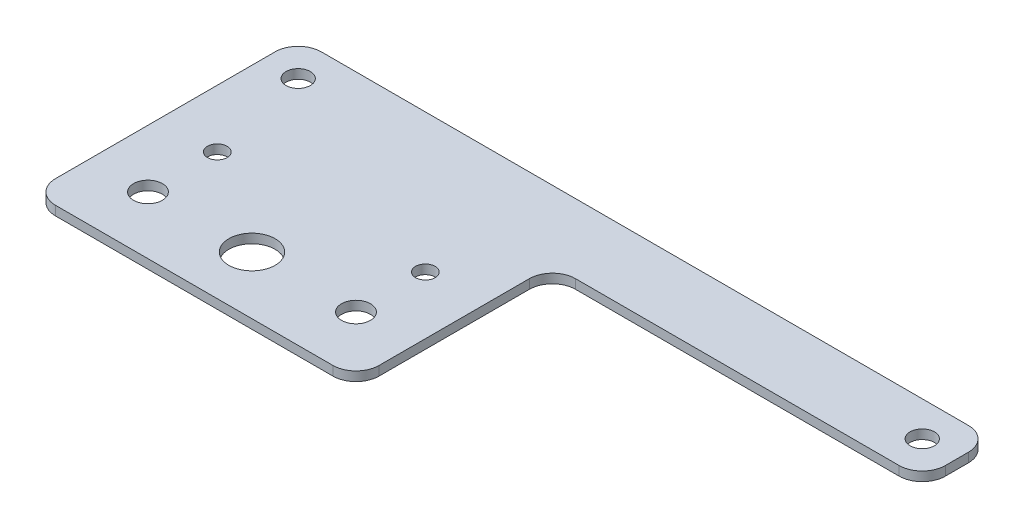
ISO-10303-21;
HEADER;
FILE_DESCRIPTION(('STEP AP214'),'2;1');
FILE_NAME('part.step','',(''),(''),'','','');
FILE_SCHEMA(('AUTOMOTIVE_DESIGN { 1 0 10303 214 1 1 1 1 }'));
ENDSEC;
DATA;
#1=APPLICATION_CONTEXT('core data for automotive mechanical design processes');
#2=APPLICATION_PROTOCOL_DEFINITION('international standard','automotive_design',2000,#1);
#3=PRODUCT_CONTEXT('',#1,'mechanical');
#4=PRODUCT('Part','Part','',(#3));
#5=PRODUCT_RELATED_PRODUCT_CATEGORY('part','',(#4));
#6=PRODUCT_DEFINITION_FORMATION('','',#4);
#7=PRODUCT_DEFINITION_CONTEXT('part definition',#1,'design');
#8=PRODUCT_DEFINITION('design','',#6,#7);
#9=PRODUCT_DEFINITION_SHAPE('','',#8);
#10=(LENGTH_UNIT() NAMED_UNIT(*) SI_UNIT(.MILLI.,.METRE.));
#11=(NAMED_UNIT(*) PLANE_ANGLE_UNIT() SI_UNIT($,.RADIAN.));
#12=(NAMED_UNIT(*) SI_UNIT($,.STERADIAN.) SOLID_ANGLE_UNIT());
#13=UNCERTAINTY_MEASURE_WITH_UNIT(LENGTH_MEASURE(1.E-05),#10,'distance_accuracy_value','');
#14=(GEOMETRIC_REPRESENTATION_CONTEXT(3) GLOBAL_UNCERTAINTY_ASSIGNED_CONTEXT((#13)) GLOBAL_UNIT_ASSIGNED_CONTEXT((#10,
#11,#12)) REPRESENTATION_CONTEXT('',''));
#15=CARTESIAN_POINT('',(0.,0.,0.));
#16=DIRECTION('',(0.,0.,1.));
#17=DIRECTION('',(1.,0.,0.));
#18=AXIS2_PLACEMENT_3D('',#15,#16,#17);
#19=CARTESIAN_POINT('',(-70.,-4.,-72.5));
#20=DIRECTION('',(0.,0.,-1.));
#21=DIRECTION('',(-1.,0.,0.));
#22=AXIS2_PLACEMENT_3D('',#19,#20,#21);
#23=PLANE('',#22);
#24=DIRECTION('',(-1.,0.,0.));
#25=VECTOR('',#24,1.);
#26=CARTESIAN_POINT('',(-70.,0.,-72.5));
#27=LINE('',#26,#25);
#28=CARTESIAN_POINT('',(220.,0.,-72.5));
#29=VERTEX_POINT('',#28);
#30=CARTESIAN_POINT('',(-60.,0.,-72.5));
#31=VERTEX_POINT('',#30);
#32=EDGE_CURVE('E159',#29,#31,#27,.T.);
#33=ORIENTED_EDGE('',*,*,#32,.F.);
#34=DIRECTION('',(0.,1.,0.));
#35=VECTOR('',#34,1.);
#36=CARTESIAN_POINT('',(220.,-4.,-72.5));
#37=LINE('',#36,#35);
#38=CARTESIAN_POINT('',(220.,-4.,-72.5));
#39=VERTEX_POINT('',#38);
#40=EDGE_CURVE('E188',#29,#39,#37,.F.);
#41=ORIENTED_EDGE('',*,*,#40,.T.);
#42=DIRECTION('',(-1.,0.,0.));
#43=VECTOR('',#42,1.);
#44=CARTESIAN_POINT('',(-70.,-4.,-72.5));
#45=LINE('',#44,#43);
#46=CARTESIAN_POINT('',(-60.,-4.,-72.5));
#47=VERTEX_POINT('',#46);
#48=EDGE_CURVE('E151',#39,#47,#45,.T.);
#49=ORIENTED_EDGE('',*,*,#48,.T.);
#50=DIRECTION('',(0.,1.,0.));
#51=VECTOR('',#50,1.);
#52=CARTESIAN_POINT('',(-60.,-4.,-72.5));
#53=LINE('',#52,#51);
#54=EDGE_CURVE('E185',#47,#31,#53,.T.);
#55=ORIENTED_EDGE('',*,*,#54,.T.);
#56=EDGE_LOOP('',(#33,#41,#49,#55));
#57=FACE_BOUND('',#56,.T.);
#58=ADVANCED_FACE('F40',(#57),#23,.T.);
#59=CARTESIAN_POINT('',(230.,-4.,-42.5));
#60=DIRECTION('',(1.,0.,0.));
#61=DIRECTION('',(0.,0.,-1.));
#62=AXIS2_PLACEMENT_3D('',#59,#60,#61);
#63=PLANE('',#62);
#64=DIRECTION('',(0.,0.,-1.));
#65=VECTOR('',#64,1.);
#66=CARTESIAN_POINT('',(230.,0.,-42.5));
#67=LINE('',#66,#65);
#68=CARTESIAN_POINT('',(230.,0.,-52.5));
#69=VERTEX_POINT('',#68);
#70=CARTESIAN_POINT('',(230.,0.,-62.5));
#71=VERTEX_POINT('',#70);
#72=EDGE_CURVE('E148',#69,#71,#67,.T.);
#73=ORIENTED_EDGE('',*,*,#72,.F.);
#74=DIRECTION('',(0.,1.,0.));
#75=VECTOR('',#74,1.);
#76=CARTESIAN_POINT('',(230.,-4.,-52.5));
#77=LINE('',#76,#75);
#78=CARTESIAN_POINT('',(230.,-4.,-52.5));
#79=VERTEX_POINT('',#78);
#80=EDGE_CURVE('E174',#69,#79,#77,.F.);
#81=ORIENTED_EDGE('',*,*,#80,.T.);
#82=DIRECTION('',(0.,0.,-1.));
#83=VECTOR('',#82,1.);
#84=CARTESIAN_POINT('',(230.,-4.,-42.5));
#85=LINE('',#84,#83);
#86=CARTESIAN_POINT('',(230.,-4.,-62.5));
#87=VERTEX_POINT('',#86);
#88=EDGE_CURVE('E156',#79,#87,#85,.T.);
#89=ORIENTED_EDGE('',*,*,#88,.T.);
#90=DIRECTION('',(0.,1.,0.));
#91=VECTOR('',#90,1.);
#92=CARTESIAN_POINT('',(230.,-4.,-62.5));
#93=LINE('',#92,#91);
#94=EDGE_CURVE('E171',#87,#71,#93,.T.);
#95=ORIENTED_EDGE('',*,*,#94,.T.);
#96=EDGE_LOOP('',(#73,#81,#89,#95));
#97=FACE_BOUND('',#96,.T.);
#98=ADVANCED_FACE('F242',(#97),#63,.T.);
#99=CARTESIAN_POINT('',(70.,-4.,-42.5));
#100=DIRECTION('',(0.,0.,1.));
#101=DIRECTION('',(1.,0.,0.));
#102=AXIS2_PLACEMENT_3D('',#99,#100,#101);
#103=PLANE('',#102);
#104=DIRECTION('',(1.,0.,0.));
#105=VECTOR('',#104,1.);
#106=CARTESIAN_POINT('',(70.,-4.,-42.5));
#107=LINE('',#106,#105);
#108=CARTESIAN_POINT('',(80.,-4.,-42.5));
#109=VERTEX_POINT('',#108);
#110=CARTESIAN_POINT('',(220.,-4.,-42.5));
#111=VERTEX_POINT('',#110);
#112=EDGE_CURVE('E209',#109,#111,#107,.T.);
#113=ORIENTED_EDGE('',*,*,#112,.T.);
#114=DIRECTION('',(0.,1.,0.));
#115=VECTOR('',#114,1.);
#116=CARTESIAN_POINT('',(220.,-4.,-42.5));
#117=LINE('',#116,#115);
#118=CARTESIAN_POINT('',(220.,0.,-42.5));
#119=VERTEX_POINT('',#118);
#120=EDGE_CURVE('E147',#111,#119,#117,.T.);
#121=ORIENTED_EDGE('',*,*,#120,.T.);
#122=DIRECTION('',(1.,0.,0.));
#123=VECTOR('',#122,1.);
#124=CARTESIAN_POINT('',(70.,0.,-42.5));
#125=LINE('',#124,#123);
#126=CARTESIAN_POINT('',(80.,0.,-42.5));
#127=VERTEX_POINT('',#126);
#128=EDGE_CURVE('E132',#127,#119,#125,.T.);
#129=ORIENTED_EDGE('',*,*,#128,.F.);
#130=DIRECTION('',(0.,1.,0.));
#131=VECTOR('',#130,1.);
#132=CARTESIAN_POINT('',(80.,-4.,-42.5));
#133=LINE('',#132,#131);
#134=EDGE_CURVE('E144',#127,#109,#133,.F.);
#135=ORIENTED_EDGE('',*,*,#134,.T.);
#136=EDGE_LOOP('',(#113,#121,#129,#135));
#137=FACE_BOUND('',#136,.T.);
#138=ADVANCED_FACE('F143',(#137),#103,.T.);
#139=CARTESIAN_POINT('',(70.,-4.,42.5));
#140=DIRECTION('',(1.,0.,0.));
#141=DIRECTION('',(0.,0.,-1.));
#142=AXIS2_PLACEMENT_3D('',#139,#140,#141);
#143=PLANE('',#142);
#144=DIRECTION('',(0.,0.,-1.));
#145=VECTOR('',#144,1.);
#146=CARTESIAN_POINT('',(70.,0.,42.5));
#147=LINE('',#146,#145);
#148=CARTESIAN_POINT('',(70.,0.,32.5));
#149=VERTEX_POINT('',#148);
#150=CARTESIAN_POINT('',(70.,0.,-32.5));
#151=VERTEX_POINT('',#150);
#152=EDGE_CURVE('E134',#149,#151,#147,.T.);
#153=ORIENTED_EDGE('',*,*,#152,.F.);
#154=DIRECTION('',(0.,1.,0.));
#155=VECTOR('',#154,1.);
#156=CARTESIAN_POINT('',(70.,-4.,32.5));
#157=LINE('',#156,#155);
#158=CARTESIAN_POINT('',(70.,-4.,32.5));
#159=VERTEX_POINT('',#158);
#160=EDGE_CURVE('E139',#149,#159,#157,.F.);
#161=ORIENTED_EDGE('',*,*,#160,.T.);
#162=DIRECTION('',(0.,0.,-1.));
#163=VECTOR('',#162,1.);
#164=CARTESIAN_POINT('',(70.,-4.,42.5));
#165=LINE('',#164,#163);
#166=CARTESIAN_POINT('',(70.,-4.,-32.5));
#167=VERTEX_POINT('',#166);
#168=EDGE_CURVE('E205',#159,#167,#165,.T.);
#169=ORIENTED_EDGE('',*,*,#168,.T.);
#170=DIRECTION('',(0.,1.,0.));
#171=VECTOR('',#170,1.);
#172=CARTESIAN_POINT('',(70.,0.,-32.5));
#173=LINE('',#172,#171);
#174=EDGE_CURVE('E199',#167,#151,#173,.T.);
#175=ORIENTED_EDGE('',*,*,#174,.T.);
#176=EDGE_LOOP('',(#153,#161,#169,#175));
#177=FACE_BOUND('',#176,.T.);
#178=ADVANCED_FACE('F204',(#177),#143,.T.);
#179=CARTESIAN_POINT('',(70.,-4.,42.5));
#180=DIRECTION('',(0.,0.,1.));
#181=DIRECTION('',(1.,0.,0.));
#182=AXIS2_PLACEMENT_3D('',#179,#180,#181);
#183=PLANE('',#182);
#184=DIRECTION('',(1.,0.,0.));
#185=VECTOR('',#184,1.);
#186=CARTESIAN_POINT('',(70.,0.,42.5));
#187=LINE('',#186,#185);
#188=CARTESIAN_POINT('',(-60.,0.,42.5));
#189=VERTEX_POINT('',#188);
#190=CARTESIAN_POINT('',(60.,0.,42.5));
#191=VERTEX_POINT('',#190);
#192=EDGE_CURVE('E216',#189,#191,#187,.T.);
#193=ORIENTED_EDGE('',*,*,#192,.F.);
#194=DIRECTION('',(0.,1.,0.));
#195=VECTOR('',#194,1.);
#196=CARTESIAN_POINT('',(-60.,-4.,42.5));
#197=LINE('',#196,#195);
#198=CARTESIAN_POINT('',(-60.,-4.,42.5));
#199=VERTEX_POINT('',#198);
#200=EDGE_CURVE('E62',#189,#199,#197,.F.);
#201=ORIENTED_EDGE('',*,*,#200,.T.);
#202=DIRECTION('',(1.,0.,0.));
#203=VECTOR('',#202,1.);
#204=CARTESIAN_POINT('',(70.,-4.,42.5));
#205=LINE('',#204,#203);
#206=CARTESIAN_POINT('',(60.,-4.,42.5));
#207=VERTEX_POINT('',#206);
#208=EDGE_CURVE('E210',#199,#207,#205,.T.);
#209=ORIENTED_EDGE('',*,*,#208,.T.);
#210=DIRECTION('',(0.,1.,0.));
#211=VECTOR('',#210,1.);
#212=CARTESIAN_POINT('',(60.,-4.,42.5));
#213=LINE('',#212,#211);
#214=EDGE_CURVE('E195',#207,#191,#213,.T.);
#215=ORIENTED_EDGE('',*,*,#214,.T.);
#216=EDGE_LOOP('',(#193,#201,#209,#215));
#217=FACE_BOUND('',#216,.T.);
#218=ADVANCED_FACE('F215',(#217),#183,.T.);
#219=CARTESIAN_POINT('',(-70.,-4.,42.5));
#220=DIRECTION('',(-1.,0.,0.));
#221=DIRECTION('',(0.,0.,1.));
#222=AXIS2_PLACEMENT_3D('',#219,#220,#221);
#223=PLANE('',#222);
#224=DIRECTION('',(0.,0.,1.));
#225=VECTOR('',#224,1.);
#226=CARTESIAN_POINT('',(-70.,0.,42.5));
#227=LINE('',#226,#225);
#228=CARTESIAN_POINT('',(-70.,0.,-62.5));
#229=VERTEX_POINT('',#228);
#230=CARTESIAN_POINT('',(-70.,0.,32.5));
#231=VERTEX_POINT('',#230);
#232=EDGE_CURVE('E218',#229,#231,#227,.T.);
#233=ORIENTED_EDGE('',*,*,#232,.F.);
#234=DIRECTION('',(0.,1.,0.));
#235=VECTOR('',#234,1.);
#236=CARTESIAN_POINT('',(-70.,-4.,-62.5));
#237=LINE('',#236,#235);
#238=CARTESIAN_POINT('',(-70.,-4.,-62.5));
#239=VERTEX_POINT('',#238);
#240=EDGE_CURVE('E193',#229,#239,#237,.F.);
#241=ORIENTED_EDGE('',*,*,#240,.T.);
#242=DIRECTION('',(0.,0.,1.));
#243=VECTOR('',#242,1.);
#244=CARTESIAN_POINT('',(-70.,-4.,-42.5));
#245=LINE('',#244,#243);
#246=CARTESIAN_POINT('',(-70.,-4.,32.5));
#247=VERTEX_POINT('',#246);
#248=EDGE_CURVE('E226',#239,#247,#245,.T.);
#249=ORIENTED_EDGE('',*,*,#248,.T.);
#250=DIRECTION('',(0.,1.,0.));
#251=VECTOR('',#250,1.);
#252=CARTESIAN_POINT('',(-70.,-4.,32.5));
#253=LINE('',#252,#251);
#254=EDGE_CURVE('E190',#247,#231,#253,.T.);
#255=ORIENTED_EDGE('',*,*,#254,.T.);
#256=EDGE_LOOP('',(#233,#241,#249,#255));
#257=FACE_BOUND('',#256,.T.);
#258=ADVANCED_FACE('F257',(#257),#223,.T.);
#259=CARTESIAN_POINT('',(0.,-4.,0.));
#260=DIRECTION('',(0.,-1.,0.));
#261=DIRECTION('',(0.,0.,-1.));
#262=AXIS2_PLACEMENT_3D('',#259,#260,#261);
#263=PLANE('',#262);
#264=CARTESIAN_POINT('',(-45.,-4.,-12.5));
#265=DIRECTION('',(0.,1.,0.));
#266=DIRECTION('',(0.,0.,1.));
#267=AXIS2_PLACEMENT_3D('',#264,#265,#266);
#268=CIRCLE('',#267,4.25000000000001);
#269=CARTESIAN_POINT('',(-45.,-4.,-8.24999999999998));
#270=VERTEX_POINT('',#269);
#271=EDGE_CURVE('E481',#270,#270,#268,.T.);
#272=ORIENTED_EDGE('',*,*,#271,.T.);
#273=EDGE_LOOP('',(#272));
#274=FACE_BOUND('',#273,.T.);
#275=CARTESIAN_POINT('',(45.,-4.,-12.5));
#276=DIRECTION('',(0.,1.,0.));
#277=DIRECTION('',(0.,0.,1.));
#278=AXIS2_PLACEMENT_3D('',#275,#276,#277);
#279=CIRCLE('',#278,4.25000000000001);
#280=CARTESIAN_POINT('',(45.,-4.,-8.24999999999998));
#281=VERTEX_POINT('',#280);
#282=EDGE_CURVE('E485',#281,#281,#279,.T.);
#283=ORIENTED_EDGE('',*,*,#282,.T.);
#284=EDGE_LOOP('',(#283));
#285=FACE_BOUND('',#284,.T.);
#286=CARTESIAN_POINT('',(45.,-4.,17.5));
#287=DIRECTION('',(0.,1.,0.));
#288=DIRECTION('',(0.,0.,1.));
#289=AXIS2_PLACEMENT_3D('',#286,#287,#288);
#290=CIRCLE('',#289,6.25);
#291=CARTESIAN_POINT('',(45.,-4.,23.75));
#292=VERTEX_POINT('',#291);
#293=EDGE_CURVE('E489',#292,#292,#290,.T.);
#294=ORIENTED_EDGE('',*,*,#293,.T.);
#295=EDGE_LOOP('',(#294));
#296=FACE_BOUND('',#295,.T.);
#297=CARTESIAN_POINT('',(0.,-4.,17.5));
#298=DIRECTION('',(0.,1.,0.));
#299=DIRECTION('',(0.,0.,1.));
#300=AXIS2_PLACEMENT_3D('',#297,#298,#299);
#301=CIRCLE('',#300,10.);
#302=CARTESIAN_POINT('',(0.,-4.,27.5));
#303=VERTEX_POINT('',#302);
#304=EDGE_CURVE('E493',#303,#303,#301,.T.);
#305=ORIENTED_EDGE('',*,*,#304,.T.);
#306=EDGE_LOOP('',(#305));
#307=FACE_BOUND('',#306,.T.);
#308=CARTESIAN_POINT('',(-45.,-4.,17.5));
#309=DIRECTION('',(0.,1.,0.));
#310=DIRECTION('',(0.,0.,1.));
#311=AXIS2_PLACEMENT_3D('',#308,#309,#310);
#312=CIRCLE('',#311,6.25);
#313=CARTESIAN_POINT('',(-45.,-4.,23.75));
#314=VERTEX_POINT('',#313);
#315=EDGE_CURVE('E497',#314,#314,#312,.T.);
#316=ORIENTED_EDGE('',*,*,#315,.T.);
#317=EDGE_LOOP('',(#316));
#318=FACE_BOUND('',#317,.T.);
#319=CARTESIAN_POINT('',(215.,-4.,-57.5));
#320=DIRECTION('',(0.,1.,0.));
#321=DIRECTION('',(0.,0.,1.));
#322=AXIS2_PLACEMENT_3D('',#319,#320,#321);
#323=CIRCLE('',#322,5.25);
#324=CARTESIAN_POINT('',(215.,-4.,-52.25));
#325=VERTEX_POINT('',#324);
#326=EDGE_CURVE('E501',#325,#325,#323,.T.);
#327=ORIENTED_EDGE('',*,*,#326,.T.);
#328=EDGE_LOOP('',(#327));
#329=FACE_BOUND('',#328,.T.);
#330=CARTESIAN_POINT('',(-55.,-4.,-57.5));
#331=DIRECTION('',(0.,1.,0.));
#332=DIRECTION('',(0.,0.,1.));
#333=AXIS2_PLACEMENT_3D('',#330,#331,#332);
#334=CIRCLE('',#333,5.25);
#335=CARTESIAN_POINT('',(-55.,-4.,-52.25));
#336=VERTEX_POINT('',#335);
#337=EDGE_CURVE('E221',#336,#336,#334,.T.);
#338=ORIENTED_EDGE('',*,*,#337,.T.);
#339=EDGE_LOOP('',(#338));
#340=FACE_BOUND('',#339,.T.);
#341=ORIENTED_EDGE('',*,*,#88,.F.);
#342=CARTESIAN_POINT('',(220.,-4.,-52.5));
#343=DIRECTION('',(0.,-1.,0.));
#344=DIRECTION('',(0.,0.,-1.));
#345=AXIS2_PLACEMENT_3D('',#342,#343,#344);
#346=CIRCLE('',#345,10.);
#347=EDGE_CURVE('E183',#79,#111,#346,.T.);
#348=ORIENTED_EDGE('',*,*,#347,.T.);
#349=ORIENTED_EDGE('',*,*,#112,.F.);
#350=CARTESIAN_POINT('',(80.,-4.,-32.5));
#351=DIRECTION('',(0.,-1.,0.));
#352=DIRECTION('',(0.,0.,-1.));
#353=AXIS2_PLACEMENT_3D('',#350,#351,#352);
#354=CIRCLE('',#353,10.);
#355=EDGE_CURVE('E11',#109,#167,#354,.F.);
#356=ORIENTED_EDGE('',*,*,#355,.T.);
#357=ORIENTED_EDGE('',*,*,#168,.F.);
#358=CARTESIAN_POINT('',(60.,-4.,32.5));
#359=DIRECTION('',(0.,-1.,0.));
#360=DIRECTION('',(0.,0.,-1.));
#361=AXIS2_PLACEMENT_3D('',#358,#359,#360);
#362=CIRCLE('',#361,10.);
#363=EDGE_CURVE('E55',#159,#207,#362,.T.);
#364=ORIENTED_EDGE('',*,*,#363,.T.);
#365=ORIENTED_EDGE('',*,*,#208,.F.);
#366=CARTESIAN_POINT('',(-60.,-4.,32.5));
#367=DIRECTION('',(0.,-1.,0.));
#368=DIRECTION('',(0.,0.,-1.));
#369=AXIS2_PLACEMENT_3D('',#366,#367,#368);
#370=CIRCLE('',#369,10.);
#371=EDGE_CURVE('E177',#199,#247,#370,.T.);
#372=ORIENTED_EDGE('',*,*,#371,.T.);
#373=ORIENTED_EDGE('',*,*,#248,.F.);
#374=CARTESIAN_POINT('',(-60.,-4.,-62.5));
#375=DIRECTION('',(0.,-1.,0.));
#376=DIRECTION('',(0.,0.,-1.));
#377=AXIS2_PLACEMENT_3D('',#374,#375,#376);
#378=CIRCLE('',#377,10.);
#379=EDGE_CURVE('E179',#239,#47,#378,.T.);
#380=ORIENTED_EDGE('',*,*,#379,.T.);
#381=ORIENTED_EDGE('',*,*,#48,.F.);
#382=CARTESIAN_POINT('',(220.,-4.,-62.5));
#383=DIRECTION('',(0.,-1.,0.));
#384=DIRECTION('',(0.,0.,-1.));
#385=AXIS2_PLACEMENT_3D('',#382,#383,#384);
#386=CIRCLE('',#385,10.);
#387=EDGE_CURVE('E181',#39,#87,#386,.T.);
#388=ORIENTED_EDGE('',*,*,#387,.T.);
#389=EDGE_LOOP('',(#341,#348,#349,#356,#357,#364,#365,#372,#373,#380,#381,#388));
#390=FACE_BOUND('',#389,.T.);
#391=ADVANCED_FACE('F208',(#274,#285,#296,#307,#318,#329,#340,#390),#263,.T.);
#392=CARTESIAN_POINT('',(0.,0.,0.));
#393=DIRECTION('',(0.,-1.,0.));
#394=DIRECTION('',(0.,0.,-1.));
#395=AXIS2_PLACEMENT_3D('',#392,#393,#394);
#396=PLANE('',#395);
#397=CARTESIAN_POINT('',(-45.,0.,-12.5));
#398=DIRECTION('',(0.,1.,0.));
#399=DIRECTION('',(0.,0.,1.));
#400=AXIS2_PLACEMENT_3D('',#397,#398,#399);
#401=CIRCLE('',#400,4.25000000000001);
#402=CARTESIAN_POINT('',(-45.,0.,-8.24999999999998));
#403=VERTEX_POINT('',#402);
#404=EDGE_CURVE('E526',#403,#403,#401,.T.);
#405=ORIENTED_EDGE('',*,*,#404,.F.);
#406=EDGE_LOOP('',(#405));
#407=FACE_BOUND('',#406,.T.);
#408=CARTESIAN_POINT('',(45.,0.,-12.5));
#409=DIRECTION('',(0.,1.,0.));
#410=DIRECTION('',(0.,0.,1.));
#411=AXIS2_PLACEMENT_3D('',#408,#409,#410);
#412=CIRCLE('',#411,4.25000000000001);
#413=CARTESIAN_POINT('',(45.,0.,-8.24999999999998));
#414=VERTEX_POINT('',#413);
#415=EDGE_CURVE('E522',#414,#414,#412,.T.);
#416=ORIENTED_EDGE('',*,*,#415,.F.);
#417=EDGE_LOOP('',(#416));
#418=FACE_BOUND('',#417,.T.);
#419=CARTESIAN_POINT('',(45.,0.,17.5));
#420=DIRECTION('',(0.,1.,0.));
#421=DIRECTION('',(0.,0.,1.));
#422=AXIS2_PLACEMENT_3D('',#419,#420,#421);
#423=CIRCLE('',#422,6.25);
#424=CARTESIAN_POINT('',(45.,0.,23.75));
#425=VERTEX_POINT('',#424);
#426=EDGE_CURVE('E518',#425,#425,#423,.T.);
#427=ORIENTED_EDGE('',*,*,#426,.F.);
#428=EDGE_LOOP('',(#427));
#429=FACE_BOUND('',#428,.T.);
#430=CARTESIAN_POINT('',(0.,0.,17.5));
#431=DIRECTION('',(0.,1.,0.));
#432=DIRECTION('',(0.,0.,1.));
#433=AXIS2_PLACEMENT_3D('',#430,#431,#432);
#434=CIRCLE('',#433,10.);
#435=CARTESIAN_POINT('',(0.,0.,27.5));
#436=VERTEX_POINT('',#435);
#437=EDGE_CURVE('E514',#436,#436,#434,.T.);
#438=ORIENTED_EDGE('',*,*,#437,.F.);
#439=EDGE_LOOP('',(#438));
#440=FACE_BOUND('',#439,.T.);
#441=CARTESIAN_POINT('',(-45.,0.,17.5));
#442=DIRECTION('',(0.,1.,0.));
#443=DIRECTION('',(0.,0.,1.));
#444=AXIS2_PLACEMENT_3D('',#441,#442,#443);
#445=CIRCLE('',#444,6.25);
#446=CARTESIAN_POINT('',(-45.,0.,23.75));
#447=VERTEX_POINT('',#446);
#448=EDGE_CURVE('E510',#447,#447,#445,.T.);
#449=ORIENTED_EDGE('',*,*,#448,.F.);
#450=EDGE_LOOP('',(#449));
#451=FACE_BOUND('',#450,.T.);
#452=CARTESIAN_POINT('',(215.,0.,-57.5));
#453=DIRECTION('',(0.,1.,0.));
#454=DIRECTION('',(0.,0.,1.));
#455=AXIS2_PLACEMENT_3D('',#452,#453,#454);
#456=CIRCLE('',#455,5.25);
#457=CARTESIAN_POINT('',(215.,0.,-52.25));
#458=VERTEX_POINT('',#457);
#459=EDGE_CURVE('E506',#458,#458,#456,.T.);
#460=ORIENTED_EDGE('',*,*,#459,.F.);
#461=EDGE_LOOP('',(#460));
#462=FACE_BOUND('',#461,.T.);
#463=CARTESIAN_POINT('',(-55.,0.,-57.5));
#464=DIRECTION('',(0.,1.,0.));
#465=DIRECTION('',(0.,0.,1.));
#466=AXIS2_PLACEMENT_3D('',#463,#464,#465);
#467=CIRCLE('',#466,5.25);
#468=CARTESIAN_POINT('',(-55.,0.,-52.25));
#469=VERTEX_POINT('',#468);
#470=EDGE_CURVE('E235',#469,#469,#467,.T.);
#471=ORIENTED_EDGE('',*,*,#470,.F.);
#472=EDGE_LOOP('',(#471));
#473=FACE_BOUND('',#472,.T.);
#474=ORIENTED_EDGE('',*,*,#128,.T.);
#475=CARTESIAN_POINT('',(220.,0.,-52.5));
#476=DIRECTION('',(0.,-1.,0.));
#477=DIRECTION('',(0.,0.,-1.));
#478=AXIS2_PLACEMENT_3D('',#475,#476,#477);
#479=CIRCLE('',#478,10.);
#480=EDGE_CURVE('E169',#119,#69,#479,.F.);
#481=ORIENTED_EDGE('',*,*,#480,.T.);
#482=ORIENTED_EDGE('',*,*,#72,.T.);
#483=CARTESIAN_POINT('',(220.,0.,-62.5));
#484=DIRECTION('',(0.,-1.,0.));
#485=DIRECTION('',(0.,0.,-1.));
#486=AXIS2_PLACEMENT_3D('',#483,#484,#485);
#487=CIRCLE('',#486,10.);
#488=EDGE_CURVE('E167',#71,#29,#487,.F.);
#489=ORIENTED_EDGE('',*,*,#488,.T.);
#490=ORIENTED_EDGE('',*,*,#32,.T.);
#491=CARTESIAN_POINT('',(-60.,0.,-62.5));
#492=DIRECTION('',(0.,-1.,0.));
#493=DIRECTION('',(0.,0.,-1.));
#494=AXIS2_PLACEMENT_3D('',#491,#492,#493);
#495=CIRCLE('',#494,10.);
#496=EDGE_CURVE('E165',#31,#229,#495,.F.);
#497=ORIENTED_EDGE('',*,*,#496,.T.);
#498=ORIENTED_EDGE('',*,*,#232,.T.);
#499=CARTESIAN_POINT('',(-60.,0.,32.5));
#500=DIRECTION('',(0.,-1.,0.));
#501=DIRECTION('',(0.,0.,-1.));
#502=AXIS2_PLACEMENT_3D('',#499,#500,#501);
#503=CIRCLE('',#502,10.);
#504=EDGE_CURVE('E163',#231,#189,#503,.F.);
#505=ORIENTED_EDGE('',*,*,#504,.T.);
#506=ORIENTED_EDGE('',*,*,#192,.T.);
#507=CARTESIAN_POINT('',(60.,0.,32.5));
#508=DIRECTION('',(0.,-1.,0.));
#509=DIRECTION('',(0.,0.,-1.));
#510=AXIS2_PLACEMENT_3D('',#507,#508,#509);
#511=CIRCLE('',#510,10.);
#512=EDGE_CURVE('E153',#191,#149,#511,.F.);
#513=ORIENTED_EDGE('',*,*,#512,.T.);
#514=ORIENTED_EDGE('',*,*,#152,.T.);
#515=CARTESIAN_POINT('',(80.,0.,-32.5));
#516=DIRECTION('',(0.,-1.,0.));
#517=DIRECTION('',(0.,0.,-1.));
#518=AXIS2_PLACEMENT_3D('',#515,#516,#517);
#519=CIRCLE('',#518,10.);
#520=EDGE_CURVE('E48',#151,#127,#519,.T.);
#521=ORIENTED_EDGE('',*,*,#520,.T.);
#522=EDGE_LOOP('',(#474,#481,#482,#489,#490,#497,#498,#505,#506,#513,#514,#521));
#523=FACE_BOUND('',#522,.T.);
#524=ADVANCED_FACE('F131',(#407,#418,#429,#440,#451,#462,#473,#523),#396,.F.);
#525=CARTESIAN_POINT('',(-55.,-4.,-57.5));
#526=DIRECTION('',(0.,1.,0.));
#527=DIRECTION('',(0.,0.,1.));
#528=AXIS2_PLACEMENT_3D('',#525,#526,#527);
#529=CYLINDRICAL_SURFACE('',#528,5.25);
#530=ORIENTED_EDGE('',*,*,#337,.F.);
#531=EDGE_LOOP('',(#530));
#532=FACE_BOUND('',#531,.T.);
#533=ORIENTED_EDGE('',*,*,#470,.T.);
#534=EDGE_LOOP('',(#533));
#535=FACE_BOUND('',#534,.T.);
#536=ADVANCED_FACE('F389',(#532,#535),#529,.F.);
#537=CARTESIAN_POINT('',(215.,-4.,-57.5));
#538=DIRECTION('',(0.,1.,0.));
#539=DIRECTION('',(0.,0.,1.));
#540=AXIS2_PLACEMENT_3D('',#537,#538,#539);
#541=CYLINDRICAL_SURFACE('',#540,5.25);
#542=ORIENTED_EDGE('',*,*,#326,.F.);
#543=EDGE_LOOP('',(#542));
#544=FACE_BOUND('',#543,.T.);
#545=ORIENTED_EDGE('',*,*,#459,.T.);
#546=EDGE_LOOP('',(#545));
#547=FACE_BOUND('',#546,.T.);
#548=ADVANCED_FACE('F378',(#544,#547),#541,.F.);
#549=CARTESIAN_POINT('',(-45.,-4.,17.5));
#550=DIRECTION('',(0.,1.,0.));
#551=DIRECTION('',(0.,0.,1.));
#552=AXIS2_PLACEMENT_3D('',#549,#550,#551);
#553=CYLINDRICAL_SURFACE('',#552,6.25);
#554=ORIENTED_EDGE('',*,*,#315,.F.);
#555=EDGE_LOOP('',(#554));
#556=FACE_BOUND('',#555,.T.);
#557=ORIENTED_EDGE('',*,*,#448,.T.);
#558=EDGE_LOOP('',(#557));
#559=FACE_BOUND('',#558,.T.);
#560=ADVANCED_FACE('F367',(#556,#559),#553,.F.);
#561=CARTESIAN_POINT('',(0.,-4.,17.5));
#562=DIRECTION('',(0.,1.,0.));
#563=DIRECTION('',(0.,0.,1.));
#564=AXIS2_PLACEMENT_3D('',#561,#562,#563);
#565=CYLINDRICAL_SURFACE('',#564,10.);
#566=ORIENTED_EDGE('',*,*,#304,.F.);
#567=EDGE_LOOP('',(#566));
#568=FACE_BOUND('',#567,.T.);
#569=ORIENTED_EDGE('',*,*,#437,.T.);
#570=EDGE_LOOP('',(#569));
#571=FACE_BOUND('',#570,.T.);
#572=ADVANCED_FACE('F356',(#568,#571),#565,.F.);
#573=CARTESIAN_POINT('',(45.,-4.,17.5));
#574=DIRECTION('',(0.,1.,0.));
#575=DIRECTION('',(0.,0.,1.));
#576=AXIS2_PLACEMENT_3D('',#573,#574,#575);
#577=CYLINDRICAL_SURFACE('',#576,6.25);
#578=ORIENTED_EDGE('',*,*,#293,.F.);
#579=EDGE_LOOP('',(#578));
#580=FACE_BOUND('',#579,.T.);
#581=ORIENTED_EDGE('',*,*,#426,.T.);
#582=EDGE_LOOP('',(#581));
#583=FACE_BOUND('',#582,.T.);
#584=ADVANCED_FACE('F345',(#580,#583),#577,.F.);
#585=CARTESIAN_POINT('',(45.,-4.,-12.5));
#586=DIRECTION('',(0.,1.,0.));
#587=DIRECTION('',(0.,0.,1.));
#588=AXIS2_PLACEMENT_3D('',#585,#586,#587);
#589=CYLINDRICAL_SURFACE('',#588,4.25000000000001);
#590=ORIENTED_EDGE('',*,*,#282,.F.);
#591=EDGE_LOOP('',(#590));
#592=FACE_BOUND('',#591,.T.);
#593=ORIENTED_EDGE('',*,*,#415,.T.);
#594=EDGE_LOOP('',(#593));
#595=FACE_BOUND('',#594,.T.);
#596=ADVANCED_FACE('F334',(#592,#595),#589,.F.);
#597=CARTESIAN_POINT('',(-45.,-4.,-12.5));
#598=DIRECTION('',(0.,1.,0.));
#599=DIRECTION('',(0.,0.,1.));
#600=AXIS2_PLACEMENT_3D('',#597,#598,#599);
#601=CYLINDRICAL_SURFACE('',#600,4.25000000000001);
#602=ORIENTED_EDGE('',*,*,#271,.F.);
#603=EDGE_LOOP('',(#602));
#604=FACE_BOUND('',#603,.T.);
#605=ORIENTED_EDGE('',*,*,#404,.T.);
#606=EDGE_LOOP('',(#605));
#607=FACE_BOUND('',#606,.T.);
#608=ADVANCED_FACE('F288',(#604,#607),#601,.F.);
#609=CARTESIAN_POINT('',(220.,-4.,-52.5));
#610=DIRECTION('',(0.,1.,0.));
#611=DIRECTION('',(0.,0.,1.));
#612=AXIS2_PLACEMENT_3D('',#609,#610,#611);
#613=CYLINDRICAL_SURFACE('',#612,10.);
#614=ORIENTED_EDGE('',*,*,#347,.F.);
#615=ORIENTED_EDGE('',*,*,#80,.F.);
#616=ORIENTED_EDGE('',*,*,#480,.F.);
#617=ORIENTED_EDGE('',*,*,#120,.F.);
#618=EDGE_LOOP('',(#614,#615,#616,#617));
#619=FACE_BOUND('',#618,.T.);
#620=ADVANCED_FACE('F285',(#619),#613,.T.);
#621=CARTESIAN_POINT('',(220.,-4.,-62.5));
#622=DIRECTION('',(0.,1.,0.));
#623=DIRECTION('',(0.,0.,1.));
#624=AXIS2_PLACEMENT_3D('',#621,#622,#623);
#625=CYLINDRICAL_SURFACE('',#624,10.);
#626=ORIENTED_EDGE('',*,*,#387,.F.);
#627=ORIENTED_EDGE('',*,*,#40,.F.);
#628=ORIENTED_EDGE('',*,*,#488,.F.);
#629=ORIENTED_EDGE('',*,*,#94,.F.);
#630=EDGE_LOOP('',(#626,#627,#628,#629));
#631=FACE_BOUND('',#630,.T.);
#632=ADVANCED_FACE('F247',(#631),#625,.T.);
#633=CARTESIAN_POINT('',(-60.,-4.,-62.5));
#634=DIRECTION('',(0.,1.,0.));
#635=DIRECTION('',(0.,0.,1.));
#636=AXIS2_PLACEMENT_3D('',#633,#634,#635);
#637=CYLINDRICAL_SURFACE('',#636,10.);
#638=ORIENTED_EDGE('',*,*,#379,.F.);
#639=ORIENTED_EDGE('',*,*,#240,.F.);
#640=ORIENTED_EDGE('',*,*,#496,.F.);
#641=ORIENTED_EDGE('',*,*,#54,.F.);
#642=EDGE_LOOP('',(#638,#639,#640,#641));
#643=FACE_BOUND('',#642,.T.);
#644=ADVANCED_FACE('F254',(#643),#637,.T.);
#645=CARTESIAN_POINT('',(-60.,-4.,32.5));
#646=DIRECTION('',(0.,1.,0.));
#647=DIRECTION('',(0.,0.,1.));
#648=AXIS2_PLACEMENT_3D('',#645,#646,#647);
#649=CYLINDRICAL_SURFACE('',#648,10.);
#650=ORIENTED_EDGE('',*,*,#371,.F.);
#651=ORIENTED_EDGE('',*,*,#200,.F.);
#652=ORIENTED_EDGE('',*,*,#504,.F.);
#653=ORIENTED_EDGE('',*,*,#254,.F.);
#654=EDGE_LOOP('',(#650,#651,#652,#653));
#655=FACE_BOUND('',#654,.T.);
#656=ADVANCED_FACE('F260',(#655),#649,.T.);
#657=CARTESIAN_POINT('',(60.,-4.,32.5));
#658=DIRECTION('',(0.,1.,0.));
#659=DIRECTION('',(0.,0.,1.));
#660=AXIS2_PLACEMENT_3D('',#657,#658,#659);
#661=CYLINDRICAL_SURFACE('',#660,10.);
#662=ORIENTED_EDGE('',*,*,#363,.F.);
#663=ORIENTED_EDGE('',*,*,#160,.F.);
#664=ORIENTED_EDGE('',*,*,#512,.F.);
#665=ORIENTED_EDGE('',*,*,#214,.F.);
#666=EDGE_LOOP('',(#662,#663,#664,#665));
#667=FACE_BOUND('',#666,.T.);
#668=ADVANCED_FACE('F213',(#667),#661,.T.);
#669=CARTESIAN_POINT('',(80.,-4.,-32.5));
#670=DIRECTION('',(0.,-1.,0.));
#671=DIRECTION('',(0.,0.,-1.));
#672=AXIS2_PLACEMENT_3D('',#669,#670,#671);
#673=CYLINDRICAL_SURFACE('',#672,10.);
#674=ORIENTED_EDGE('',*,*,#355,.F.);
#675=ORIENTED_EDGE('',*,*,#134,.F.);
#676=ORIENTED_EDGE('',*,*,#520,.F.);
#677=ORIENTED_EDGE('',*,*,#174,.F.);
#678=EDGE_LOOP('',(#674,#675,#676,#677));
#679=FACE_BOUND('',#678,.T.);
#680=ADVANCED_FACE('F42',(#679),#673,.F.);
#681=CLOSED_SHELL('',(#58,#98,#138,#178,#218,#258,#391,#524,#536,#548,#560,#572,#584,#596,#608,
#620,#632,#644,#656,#668,#680));
#682=MANIFOLD_SOLID_BREP('B2',#681);
#683=ADVANCED_BREP_SHAPE_REPRESENTATION('',(#18,#682),#14);
#684=SHAPE_DEFINITION_REPRESENTATION(#9,#683);
ENDSEC;
END-ISO-10303-21;
